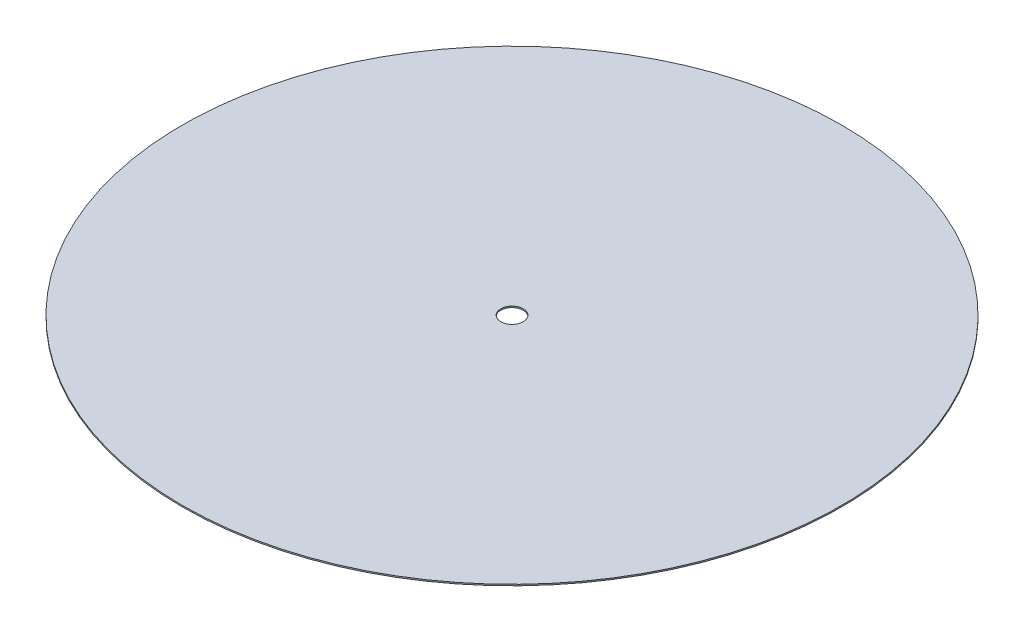
ISO-10303-21;
HEADER;
FILE_DESCRIPTION(('STEP AP214'),'2;1');
FILE_NAME('part.step','',(''),(''),'','','');
FILE_SCHEMA(('AUTOMOTIVE_DESIGN { 1 0 10303 214 1 1 1 1 }'));
ENDSEC;
DATA;
#1=APPLICATION_CONTEXT('core data for automotive mechanical design processes');
#2=APPLICATION_PROTOCOL_DEFINITION('international standard','automotive_design',2000,#1);
#3=PRODUCT_CONTEXT('',#1,'mechanical');
#4=PRODUCT('Part','Part','',(#3));
#5=PRODUCT_RELATED_PRODUCT_CATEGORY('part','',(#4));
#6=PRODUCT_DEFINITION_FORMATION('','',#4);
#7=PRODUCT_DEFINITION_CONTEXT('part definition',#1,'design');
#8=PRODUCT_DEFINITION('design','',#6,#7);
#9=PRODUCT_DEFINITION_SHAPE('','',#8);
#10=(LENGTH_UNIT() NAMED_UNIT(*) SI_UNIT(.MILLI.,.METRE.));
#11=(NAMED_UNIT(*) PLANE_ANGLE_UNIT() SI_UNIT($,.RADIAN.));
#12=(NAMED_UNIT(*) SI_UNIT($,.STERADIAN.) SOLID_ANGLE_UNIT());
#13=UNCERTAINTY_MEASURE_WITH_UNIT(LENGTH_MEASURE(1.E-05),#10,'distance_accuracy_value','');
#14=(GEOMETRIC_REPRESENTATION_CONTEXT(3) GLOBAL_UNCERTAINTY_ASSIGNED_CONTEXT((#13)) GLOBAL_UNIT_ASSIGNED_CONTEXT((#10,
#11,#12)) REPRESENTATION_CONTEXT('',''));
#15=CARTESIAN_POINT('',(0.,0.,0.));
#16=DIRECTION('',(0.,0.,1.));
#17=DIRECTION('',(1.,0.,0.));
#18=AXIS2_PLACEMENT_3D('',#15,#16,#17);
#19=CARTESIAN_POINT('',(0.,1058.,0.));
#20=DIRECTION('',(0.,1.,0.));
#21=DIRECTION('',(0.,0.,1.));
#22=AXIS2_PLACEMENT_3D('',#19,#20,#21);
#23=PLANE('',#22);
#24=CARTESIAN_POINT('',(0.,1058.,0.));
#25=DIRECTION('',(0.,1.,0.));
#26=DIRECTION('',(0.,0.,1.));
#27=AXIS2_PLACEMENT_3D('',#24,#25,#26);
#28=CIRCLE('',#27,740.);
#29=CARTESIAN_POINT('',(0.,1058.,740.));
#30=VERTEX_POINT('',#29);
#31=EDGE_CURVE('E10',#30,#30,#28,.T.);
#32=ORIENTED_EDGE('',*,*,#31,.T.);
#33=EDGE_LOOP('',(#32));
#34=FACE_BOUND('',#33,.T.);
#35=CARTESIAN_POINT('',(0.,1058.,0.));
#36=DIRECTION('',(0.,1.,0.));
#37=DIRECTION('',(0.,0.,1.));
#38=AXIS2_PLACEMENT_3D('',#35,#36,#37);
#39=CIRCLE('',#38,25.2);
#40=CARTESIAN_POINT('',(0.,1058.,25.2));
#41=VERTEX_POINT('',#40);
#42=EDGE_CURVE('E45',#41,#41,#39,.T.);
#43=ORIENTED_EDGE('',*,*,#42,.F.);
#44=EDGE_LOOP('',(#43));
#45=FACE_BOUND('',#44,.T.);
#46=ADVANCED_FACE('F34',(#34,#45),#23,.T.);
#47=CARTESIAN_POINT('',(0.,1055.,0.));
#48=DIRECTION('',(0.,1.,0.));
#49=DIRECTION('',(0.,0.,1.));
#50=AXIS2_PLACEMENT_3D('',#47,#48,#49);
#51=PLANE('',#50);
#52=CARTESIAN_POINT('',(0.,1055.,0.));
#53=DIRECTION('',(0.,1.,0.));
#54=DIRECTION('',(0.,0.,1.));
#55=AXIS2_PLACEMENT_3D('',#52,#53,#54);
#56=CIRCLE('',#55,740.);
#57=CARTESIAN_POINT('',(0.,1055.,740.));
#58=VERTEX_POINT('',#57);
#59=EDGE_CURVE('E38',#58,#58,#56,.T.);
#60=ORIENTED_EDGE('',*,*,#59,.F.);
#61=EDGE_LOOP('',(#60));
#62=FACE_BOUND('',#61,.T.);
#63=CARTESIAN_POINT('',(0.,1055.,0.));
#64=DIRECTION('',(0.,1.,0.));
#65=DIRECTION('',(0.,0.,1.));
#66=AXIS2_PLACEMENT_3D('',#63,#64,#65);
#67=CIRCLE('',#66,25.2);
#68=CARTESIAN_POINT('',(0.,1055.,25.2));
#69=VERTEX_POINT('',#68);
#70=EDGE_CURVE('E47',#69,#69,#67,.T.);
#71=ORIENTED_EDGE('',*,*,#70,.T.);
#72=EDGE_LOOP('',(#71));
#73=FACE_BOUND('',#72,.T.);
#74=ADVANCED_FACE('F57',(#62,#73),#51,.F.);
#75=CARTESIAN_POINT('',(0.,1058.,0.));
#76=DIRECTION('',(0.,-1.,0.));
#77=DIRECTION('',(0.,0.,-1.));
#78=AXIS2_PLACEMENT_3D('',#75,#76,#77);
#79=CYLINDRICAL_SURFACE('',#78,740.);
#80=ORIENTED_EDGE('',*,*,#31,.F.);
#81=EDGE_LOOP('',(#80));
#82=FACE_BOUND('',#81,.T.);
#83=ORIENTED_EDGE('',*,*,#59,.T.);
#84=EDGE_LOOP('',(#83));
#85=FACE_BOUND('',#84,.T.);
#86=ADVANCED_FACE('F36',(#82,#85),#79,.T.);
#87=CARTESIAN_POINT('',(0.,1058.,0.));
#88=DIRECTION('',(0.,-1.,0.));
#89=DIRECTION('',(0.,0.,-1.));
#90=AXIS2_PLACEMENT_3D('',#87,#88,#89);
#91=CYLINDRICAL_SURFACE('',#90,25.2);
#92=ORIENTED_EDGE('',*,*,#42,.T.);
#93=EDGE_LOOP('',(#92));
#94=FACE_BOUND('',#93,.T.);
#95=ORIENTED_EDGE('',*,*,#70,.F.);
#96=EDGE_LOOP('',(#95));
#97=FACE_BOUND('',#96,.T.);
#98=ADVANCED_FACE('F53',(#94,#97),#91,.F.);
#99=CLOSED_SHELL('',(#46,#74,#86,#98));
#100=MANIFOLD_SOLID_BREP('B2',#99);
#101=ADVANCED_BREP_SHAPE_REPRESENTATION('',(#18,#100),#14);
#102=SHAPE_DEFINITION_REPRESENTATION(#9,#101);
ENDSEC;
END-ISO-10303-21;
